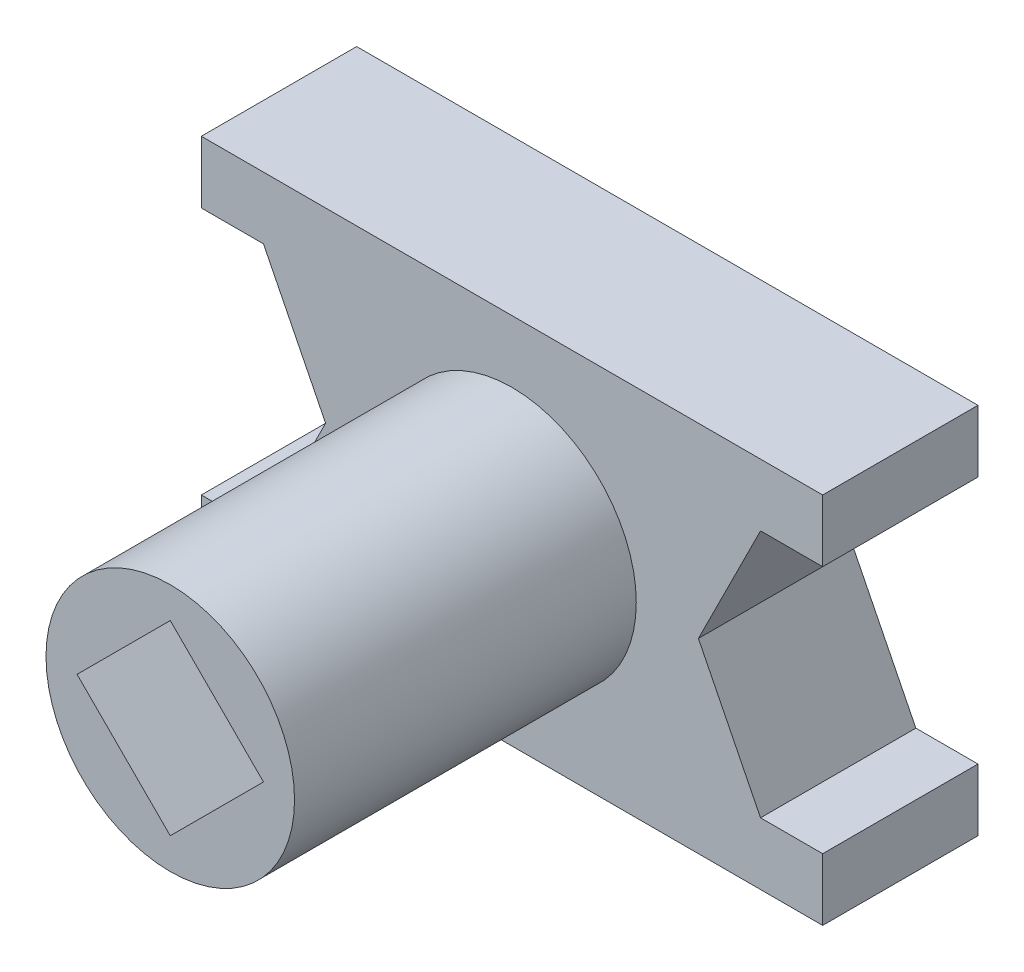
ISO-10303-21;
HEADER;
FILE_DESCRIPTION(('STEP AP214'),'2;1');
FILE_NAME('part.step','',(''),(''),'','','');
FILE_SCHEMA(('AUTOMOTIVE_DESIGN { 1 0 10303 214 1 1 1 1 }'));
ENDSEC;
DATA;
#1=APPLICATION_CONTEXT('core data for automotive mechanical design processes');
#2=APPLICATION_PROTOCOL_DEFINITION('international standard','automotive_design',2000,#1);
#3=PRODUCT_CONTEXT('',#1,'mechanical');
#4=PRODUCT('Part','Part','',(#3));
#5=PRODUCT_RELATED_PRODUCT_CATEGORY('part','',(#4));
#6=PRODUCT_DEFINITION_FORMATION('','',#4);
#7=PRODUCT_DEFINITION_CONTEXT('part definition',#1,'design');
#8=PRODUCT_DEFINITION('design','',#6,#7);
#9=PRODUCT_DEFINITION_SHAPE('','',#8);
#10=(LENGTH_UNIT() NAMED_UNIT(*) SI_UNIT(.MILLI.,.METRE.));
#11=(NAMED_UNIT(*) PLANE_ANGLE_UNIT() SI_UNIT($,.RADIAN.));
#12=(NAMED_UNIT(*) SI_UNIT($,.STERADIAN.) SOLID_ANGLE_UNIT());
#13=UNCERTAINTY_MEASURE_WITH_UNIT(LENGTH_MEASURE(1.E-05),#10,'distance_accuracy_value','');
#14=(GEOMETRIC_REPRESENTATION_CONTEXT(3) GLOBAL_UNCERTAINTY_ASSIGNED_CONTEXT((#13)) GLOBAL_UNIT_ASSIGNED_CONTEXT((#10,
#11,#12)) REPRESENTATION_CONTEXT('',''));
#15=CARTESIAN_POINT('',(0.,0.,0.));
#16=DIRECTION('',(0.,0.,1.));
#17=DIRECTION('',(1.,0.,0.));
#18=AXIS2_PLACEMENT_3D('',#15,#16,#17);
#19=CARTESIAN_POINT('',(-50.,20.,25.));
#20=DIRECTION('',(1.,0.,0.));
#21=DIRECTION('',(0.,0.,-1.));
#22=AXIS2_PLACEMENT_3D('',#19,#20,#21);
#23=PLANE('',#22);
#24=DIRECTION('',(0.,-1.,0.));
#25=VECTOR('',#24,1.);
#26=CARTESIAN_POINT('',(-50.,20.,0.));
#27=LINE('',#26,#25);
#28=CARTESIAN_POINT('',(-50.,30.,0.));
#29=VERTEX_POINT('',#28);
#30=CARTESIAN_POINT('',(-50.,20.,0.));
#31=VERTEX_POINT('',#30);
#32=EDGE_CURVE('E177',#29,#31,#27,.T.);
#33=ORIENTED_EDGE('',*,*,#32,.T.);
#34=DIRECTION('',(0.,0.,-1.));
#35=VECTOR('',#34,1.);
#36=CARTESIAN_POINT('',(-50.,20.,25.));
#37=LINE('',#36,#35);
#38=CARTESIAN_POINT('',(-50.,20.,25.));
#39=VERTEX_POINT('',#38);
#40=EDGE_CURVE('E11',#39,#31,#37,.T.);
#41=ORIENTED_EDGE('',*,*,#40,.F.);
#42=DIRECTION('',(0.,-1.,0.));
#43=VECTOR('',#42,1.);
#44=CARTESIAN_POINT('',(-50.,20.,25.));
#45=LINE('',#44,#43);
#46=CARTESIAN_POINT('',(-50.,30.,25.));
#47=VERTEX_POINT('',#46);
#48=EDGE_CURVE('E205',#47,#39,#45,.T.);
#49=ORIENTED_EDGE('',*,*,#48,.F.);
#50=DIRECTION('',(0.,0.,-1.));
#51=VECTOR('',#50,1.);
#52=CARTESIAN_POINT('',(-50.,30.,25.));
#53=LINE('',#52,#51);
#54=EDGE_CURVE('E173',#47,#29,#53,.T.);
#55=ORIENTED_EDGE('',*,*,#54,.T.);
#56=EDGE_LOOP('',(#33,#41,#49,#55));
#57=FACE_BOUND('',#56,.T.);
#58=ADVANCED_FACE('F33',(#57),#23,.F.);
#59=CARTESIAN_POINT('',(-50.,20.,25.));
#60=DIRECTION('',(0.,1.,0.));
#61=DIRECTION('',(0.,0.,1.));
#62=AXIS2_PLACEMENT_3D('',#59,#60,#61);
#63=PLANE('',#62);
#64=DIRECTION('',(1.,0.,0.));
#65=VECTOR('',#64,1.);
#66=CARTESIAN_POINT('',(-50.,20.,0.));
#67=LINE('',#66,#65);
#68=CARTESIAN_POINT('',(-40.,20.,0.));
#69=VERTEX_POINT('',#68);
#70=EDGE_CURVE('E180',#31,#69,#67,.T.);
#71=ORIENTED_EDGE('',*,*,#70,.T.);
#72=DIRECTION('',(0.,0.,-1.));
#73=VECTOR('',#72,1.);
#74=CARTESIAN_POINT('',(-40.,20.,25.));
#75=LINE('',#74,#73);
#76=CARTESIAN_POINT('',(-40.,20.,25.));
#77=VERTEX_POINT('',#76);
#78=EDGE_CURVE('E40',#77,#69,#75,.T.);
#79=ORIENTED_EDGE('',*,*,#78,.F.);
#80=DIRECTION('',(1.,0.,0.));
#81=VECTOR('',#80,1.);
#82=CARTESIAN_POINT('',(-50.,20.,25.));
#83=LINE('',#82,#81);
#84=EDGE_CURVE('E115',#39,#77,#83,.T.);
#85=ORIENTED_EDGE('',*,*,#84,.F.);
#86=ORIENTED_EDGE('',*,*,#40,.T.);
#87=EDGE_LOOP('',(#71,#79,#85,#86));
#88=FACE_BOUND('',#87,.T.);
#89=ADVANCED_FACE('F379',(#88),#63,.F.);
#90=CARTESIAN_POINT('',(-40.,20.,25.));
#91=DIRECTION('',(0.894427190999916,0.447213595499958,0.));
#92=DIRECTION('',(-0.447213595499958,0.894427190999916,0.));
#93=AXIS2_PLACEMENT_3D('',#90,#91,#92);
#94=PLANE('',#93);
#95=DIRECTION('',(0.447213595499958,-0.894427190999916,0.));
#96=VECTOR('',#95,1.);
#97=CARTESIAN_POINT('',(-40.,20.,0.));
#98=LINE('',#97,#96);
#99=CARTESIAN_POINT('',(-30.,0.,0.));
#100=VERTEX_POINT('',#99);
#101=EDGE_CURVE('E183',#69,#100,#98,.T.);
#102=ORIENTED_EDGE('',*,*,#101,.T.);
#103=DIRECTION('',(0.,0.,-1.));
#104=VECTOR('',#103,1.);
#105=CARTESIAN_POINT('',(-30.,0.,25.));
#106=LINE('',#105,#104);
#107=CARTESIAN_POINT('',(-30.,0.,25.));
#108=VERTEX_POINT('',#107);
#109=EDGE_CURVE('E230',#108,#100,#106,.T.);
#110=ORIENTED_EDGE('',*,*,#109,.F.);
#111=DIRECTION('',(0.447213595499958,-0.894427190999916,0.));
#112=VECTOR('',#111,1.);
#113=CARTESIAN_POINT('',(-40.,20.,25.));
#114=LINE('',#113,#112);
#115=EDGE_CURVE('E238',#77,#108,#114,.T.);
#116=ORIENTED_EDGE('',*,*,#115,.F.);
#117=ORIENTED_EDGE('',*,*,#78,.T.);
#118=EDGE_LOOP('',(#102,#110,#116,#117));
#119=FACE_BOUND('',#118,.T.);
#120=ADVANCED_FACE('F236',(#119),#94,.F.);
#121=CARTESIAN_POINT('',(-40.,-20.,25.));
#122=DIRECTION('',(0.894427190999916,-0.447213595499958,0.));
#123=DIRECTION('',(0.447213595499958,0.894427190999916,0.));
#124=AXIS2_PLACEMENT_3D('',#121,#122,#123);
#125=PLANE('',#124);
#126=DIRECTION('',(-0.447213595499958,-0.894427190999916,0.));
#127=VECTOR('',#126,1.);
#128=CARTESIAN_POINT('',(-40.,-20.,0.));
#129=LINE('',#128,#127);
#130=CARTESIAN_POINT('',(-40.,-20.,0.));
#131=VERTEX_POINT('',#130);
#132=EDGE_CURVE('E185',#100,#131,#129,.T.);
#133=ORIENTED_EDGE('',*,*,#132,.T.);
#134=DIRECTION('',(0.,0.,-1.));
#135=VECTOR('',#134,1.);
#136=CARTESIAN_POINT('',(-40.,-20.,25.));
#137=LINE('',#136,#135);
#138=CARTESIAN_POINT('',(-40.,-20.,25.));
#139=VERTEX_POINT('',#138);
#140=EDGE_CURVE('E227',#139,#131,#137,.T.);
#141=ORIENTED_EDGE('',*,*,#140,.F.);
#142=DIRECTION('',(-0.447213595499958,-0.894427190999916,0.));
#143=VECTOR('',#142,1.);
#144=CARTESIAN_POINT('',(-40.,-20.,25.));
#145=LINE('',#144,#143);
#146=EDGE_CURVE('E256',#108,#139,#145,.T.);
#147=ORIENTED_EDGE('',*,*,#146,.F.);
#148=ORIENTED_EDGE('',*,*,#109,.T.);
#149=EDGE_LOOP('',(#133,#141,#147,#148));
#150=FACE_BOUND('',#149,.T.);
#151=ADVANCED_FACE('F247',(#150),#125,.F.);
#152=CARTESIAN_POINT('',(-50.,-20.,25.));
#153=DIRECTION('',(0.,-1.,0.));
#154=DIRECTION('',(0.,0.,-1.));
#155=AXIS2_PLACEMENT_3D('',#152,#153,#154);
#156=PLANE('',#155);
#157=DIRECTION('',(-1.,0.,0.));
#158=VECTOR('',#157,1.);
#159=CARTESIAN_POINT('',(-50.,-20.,0.));
#160=LINE('',#159,#158);
#161=CARTESIAN_POINT('',(-50.,-20.,0.));
#162=VERTEX_POINT('',#161);
#163=EDGE_CURVE('E187',#131,#162,#160,.T.);
#164=ORIENTED_EDGE('',*,*,#163,.T.);
#165=DIRECTION('',(0.,0.,-1.));
#166=VECTOR('',#165,1.);
#167=CARTESIAN_POINT('',(-50.,-20.,25.));
#168=LINE('',#167,#166);
#169=CARTESIAN_POINT('',(-50.,-20.,25.));
#170=VERTEX_POINT('',#169);
#171=EDGE_CURVE('E224',#170,#162,#168,.T.);
#172=ORIENTED_EDGE('',*,*,#171,.F.);
#173=DIRECTION('',(-1.,0.,0.));
#174=VECTOR('',#173,1.);
#175=CARTESIAN_POINT('',(-50.,-20.,25.));
#176=LINE('',#175,#174);
#177=EDGE_CURVE('E253',#139,#170,#176,.T.);
#178=ORIENTED_EDGE('',*,*,#177,.F.);
#179=ORIENTED_EDGE('',*,*,#140,.T.);
#180=EDGE_LOOP('',(#164,#172,#178,#179));
#181=FACE_BOUND('',#180,.T.);
#182=ADVANCED_FACE('F251',(#181),#156,.F.);
#183=CARTESIAN_POINT('',(-50.,-30.,25.));
#184=DIRECTION('',(1.,0.,0.));
#185=DIRECTION('',(0.,0.,-1.));
#186=AXIS2_PLACEMENT_3D('',#183,#184,#185);
#187=PLANE('',#186);
#188=DIRECTION('',(0.,-1.,0.));
#189=VECTOR('',#188,1.);
#190=CARTESIAN_POINT('',(-50.,-30.,0.));
#191=LINE('',#190,#189);
#192=CARTESIAN_POINT('',(-50.,-30.,0.));
#193=VERTEX_POINT('',#192);
#194=EDGE_CURVE('E189',#162,#193,#191,.T.);
#195=ORIENTED_EDGE('',*,*,#194,.T.);
#196=DIRECTION('',(0.,0.,-1.));
#197=VECTOR('',#196,1.);
#198=CARTESIAN_POINT('',(-50.,-30.,25.));
#199=LINE('',#198,#197);
#200=CARTESIAN_POINT('',(-50.,-30.,25.));
#201=VERTEX_POINT('',#200);
#202=EDGE_CURVE('E221',#201,#193,#199,.T.);
#203=ORIENTED_EDGE('',*,*,#202,.F.);
#204=DIRECTION('',(0.,-1.,0.));
#205=VECTOR('',#204,1.);
#206=CARTESIAN_POINT('',(-50.,-30.,25.));
#207=LINE('',#206,#205);
#208=EDGE_CURVE('E255',#170,#201,#207,.T.);
#209=ORIENTED_EDGE('',*,*,#208,.F.);
#210=ORIENTED_EDGE('',*,*,#171,.T.);
#211=EDGE_LOOP('',(#195,#203,#209,#210));
#212=FACE_BOUND('',#211,.T.);
#213=ADVANCED_FACE('F392',(#212),#187,.F.);
#214=CARTESIAN_POINT('',(50.,-30.,25.));
#215=DIRECTION('',(0.,1.,0.));
#216=DIRECTION('',(-1.,0.,0.));
#217=AXIS2_PLACEMENT_3D('',#214,#215,#216);
#218=PLANE('',#217);
#219=DIRECTION('',(1.,0.,0.));
#220=VECTOR('',#219,1.);
#221=CARTESIAN_POINT('',(50.,-30.,0.));
#222=LINE('',#221,#220);
#223=CARTESIAN_POINT('',(50.,-30.,0.));
#224=VERTEX_POINT('',#223);
#225=EDGE_CURVE('E191',#193,#224,#222,.T.);
#226=ORIENTED_EDGE('',*,*,#225,.T.);
#227=DIRECTION('',(0.,0.,-1.));
#228=VECTOR('',#227,1.);
#229=CARTESIAN_POINT('',(50.,-30.,25.));
#230=LINE('',#229,#228);
#231=CARTESIAN_POINT('',(50.,-30.,25.));
#232=VERTEX_POINT('',#231);
#233=EDGE_CURVE('E218',#232,#224,#230,.T.);
#234=ORIENTED_EDGE('',*,*,#233,.F.);
#235=DIRECTION('',(1.,0.,0.));
#236=VECTOR('',#235,1.);
#237=CARTESIAN_POINT('',(50.,-30.,25.));
#238=LINE('',#237,#236);
#239=EDGE_CURVE('E258',#201,#232,#238,.T.);
#240=ORIENTED_EDGE('',*,*,#239,.F.);
#241=ORIENTED_EDGE('',*,*,#202,.T.);
#242=EDGE_LOOP('',(#226,#234,#240,#241));
#243=FACE_BOUND('',#242,.T.);
#244=ADVANCED_FACE('F395',(#243),#218,.F.);
#245=CARTESIAN_POINT('',(50.,-30.,25.));
#246=DIRECTION('',(-1.,0.,0.));
#247=DIRECTION('',(0.,-1.,0.));
#248=AXIS2_PLACEMENT_3D('',#245,#246,#247);
#249=PLANE('',#248);
#250=DIRECTION('',(0.,1.,0.));
#251=VECTOR('',#250,1.);
#252=CARTESIAN_POINT('',(50.,-30.,0.));
#253=LINE('',#252,#251);
#254=CARTESIAN_POINT('',(50.,-20.,0.));
#255=VERTEX_POINT('',#254);
#256=EDGE_CURVE('E193',#224,#255,#253,.T.);
#257=ORIENTED_EDGE('',*,*,#256,.T.);
#258=DIRECTION('',(0.,0.,-1.));
#259=VECTOR('',#258,1.);
#260=CARTESIAN_POINT('',(50.,-20.,25.));
#261=LINE('',#260,#259);
#262=CARTESIAN_POINT('',(50.,-20.,25.));
#263=VERTEX_POINT('',#262);
#264=EDGE_CURVE('E215',#263,#255,#261,.T.);
#265=ORIENTED_EDGE('',*,*,#264,.F.);
#266=DIRECTION('',(0.,1.,0.));
#267=VECTOR('',#266,1.);
#268=CARTESIAN_POINT('',(50.,-30.,25.));
#269=LINE('',#268,#267);
#270=EDGE_CURVE('E264',#232,#263,#269,.T.);
#271=ORIENTED_EDGE('',*,*,#270,.F.);
#272=ORIENTED_EDGE('',*,*,#233,.T.);
#273=EDGE_LOOP('',(#257,#265,#271,#272));
#274=FACE_BOUND('',#273,.T.);
#275=ADVANCED_FACE('F399',(#274),#249,.F.);
#276=CARTESIAN_POINT('',(50.,-20.,25.));
#277=DIRECTION('',(0.,-1.,0.));
#278=DIRECTION('',(0.,0.,-1.));
#279=AXIS2_PLACEMENT_3D('',#276,#277,#278);
#280=PLANE('',#279);
#281=DIRECTION('',(-1.,0.,0.));
#282=VECTOR('',#281,1.);
#283=CARTESIAN_POINT('',(50.,-20.,0.));
#284=LINE('',#283,#282);
#285=CARTESIAN_POINT('',(40.,-20.,0.));
#286=VERTEX_POINT('',#285);
#287=EDGE_CURVE('E195',#255,#286,#284,.T.);
#288=ORIENTED_EDGE('',*,*,#287,.T.);
#289=DIRECTION('',(0.,0.,-1.));
#290=VECTOR('',#289,1.);
#291=CARTESIAN_POINT('',(40.,-20.,25.));
#292=LINE('',#291,#290);
#293=CARTESIAN_POINT('',(40.,-20.,25.));
#294=VERTEX_POINT('',#293);
#295=EDGE_CURVE('E212',#294,#286,#292,.T.);
#296=ORIENTED_EDGE('',*,*,#295,.F.);
#297=DIRECTION('',(-1.,0.,0.));
#298=VECTOR('',#297,1.);
#299=CARTESIAN_POINT('',(50.,-20.,25.));
#300=LINE('',#299,#298);
#301=EDGE_CURVE('E266',#263,#294,#300,.T.);
#302=ORIENTED_EDGE('',*,*,#301,.F.);
#303=ORIENTED_EDGE('',*,*,#264,.T.);
#304=EDGE_LOOP('',(#288,#296,#302,#303));
#305=FACE_BOUND('',#304,.T.);
#306=ADVANCED_FACE('F403',(#305),#280,.F.);
#307=CARTESIAN_POINT('',(40.,-20.,25.));
#308=DIRECTION('',(-0.894427190999915,-0.447213595499959,0.));
#309=DIRECTION('',(0.447213595499959,-0.894427190999916,0.));
#310=AXIS2_PLACEMENT_3D('',#307,#308,#309);
#311=PLANE('',#310);
#312=DIRECTION('',(-0.447213595499959,0.894427190999916,0.));
#313=VECTOR('',#312,1.);
#314=CARTESIAN_POINT('',(40.,-20.,0.));
#315=LINE('',#314,#313);
#316=CARTESIAN_POINT('',(30.,0.,0.));
#317=VERTEX_POINT('',#316);
#318=EDGE_CURVE('E197',#286,#317,#315,.T.);
#319=ORIENTED_EDGE('',*,*,#318,.T.);
#320=DIRECTION('',(0.,0.,-1.));
#321=VECTOR('',#320,1.);
#322=CARTESIAN_POINT('',(30.,0.,25.));
#323=LINE('',#322,#321);
#324=CARTESIAN_POINT('',(30.,0.,25.));
#325=VERTEX_POINT('',#324);
#326=EDGE_CURVE('E209',#325,#317,#323,.T.);
#327=ORIENTED_EDGE('',*,*,#326,.F.);
#328=DIRECTION('',(-0.447213595499959,0.894427190999916,0.));
#329=VECTOR('',#328,1.);
#330=CARTESIAN_POINT('',(40.,-20.,25.));
#331=LINE('',#330,#329);
#332=EDGE_CURVE('E268',#294,#325,#331,.T.);
#333=ORIENTED_EDGE('',*,*,#332,.F.);
#334=ORIENTED_EDGE('',*,*,#295,.T.);
#335=EDGE_LOOP('',(#319,#327,#333,#334));
#336=FACE_BOUND('',#335,.T.);
#337=ADVANCED_FACE('F274',(#336),#311,.F.);
#338=CARTESIAN_POINT('',(40.,20.,25.));
#339=DIRECTION('',(-0.894427190999916,0.447213595499958,0.));
#340=DIRECTION('',(-0.447213595499958,-0.894427190999916,0.));
#341=AXIS2_PLACEMENT_3D('',#338,#339,#340);
#342=PLANE('',#341);
#343=DIRECTION('',(0.447213595499958,0.894427190999916,0.));
#344=VECTOR('',#343,1.);
#345=CARTESIAN_POINT('',(40.,20.,0.));
#346=LINE('',#345,#344);
#347=CARTESIAN_POINT('',(40.,20.,0.));
#348=VERTEX_POINT('',#347);
#349=EDGE_CURVE('E199',#317,#348,#346,.T.);
#350=ORIENTED_EDGE('',*,*,#349,.T.);
#351=DIRECTION('',(0.,0.,-1.));
#352=VECTOR('',#351,1.);
#353=CARTESIAN_POINT('',(40.,20.,25.));
#354=LINE('',#353,#352);
#355=CARTESIAN_POINT('',(40.,20.,25.));
#356=VERTEX_POINT('',#355);
#357=EDGE_CURVE('E168',#356,#348,#354,.T.);
#358=ORIENTED_EDGE('',*,*,#357,.F.);
#359=DIRECTION('',(0.447213595499958,0.894427190999916,0.));
#360=VECTOR('',#359,1.);
#361=CARTESIAN_POINT('',(40.,20.,25.));
#362=LINE('',#361,#360);
#363=EDGE_CURVE('E156',#325,#356,#362,.T.);
#364=ORIENTED_EDGE('',*,*,#363,.F.);
#365=ORIENTED_EDGE('',*,*,#326,.T.);
#366=EDGE_LOOP('',(#350,#358,#364,#365));
#367=FACE_BOUND('',#366,.T.);
#368=ADVANCED_FACE('F278',(#367),#342,.F.);
#369=CARTESIAN_POINT('',(50.,20.,25.));
#370=DIRECTION('',(0.,1.,0.));
#371=DIRECTION('',(0.,0.,1.));
#372=AXIS2_PLACEMENT_3D('',#369,#370,#371);
#373=PLANE('',#372);
#374=DIRECTION('',(1.,0.,0.));
#375=VECTOR('',#374,1.);
#376=CARTESIAN_POINT('',(50.,20.,0.));
#377=LINE('',#376,#375);
#378=CARTESIAN_POINT('',(50.,20.,0.));
#379=VERTEX_POINT('',#378);
#380=EDGE_CURVE('E165',#348,#379,#377,.T.);
#381=ORIENTED_EDGE('',*,*,#380,.T.);
#382=DIRECTION('',(0.,0.,-1.));
#383=VECTOR('',#382,1.);
#384=CARTESIAN_POINT('',(50.,20.,25.));
#385=LINE('',#384,#383);
#386=CARTESIAN_POINT('',(50.,20.,25.));
#387=VERTEX_POINT('',#386);
#388=EDGE_CURVE('E162',#387,#379,#385,.T.);
#389=ORIENTED_EDGE('',*,*,#388,.F.);
#390=DIRECTION('',(1.,0.,0.));
#391=VECTOR('',#390,1.);
#392=CARTESIAN_POINT('',(50.,20.,25.));
#393=LINE('',#392,#391);
#394=EDGE_CURVE('E149',#356,#387,#393,.T.);
#395=ORIENTED_EDGE('',*,*,#394,.F.);
#396=ORIENTED_EDGE('',*,*,#357,.T.);
#397=EDGE_LOOP('',(#381,#389,#395,#396));
#398=FACE_BOUND('',#397,.T.);
#399=ADVANCED_FACE('F163',(#398),#373,.F.);
#400=CARTESIAN_POINT('',(50.,20.,25.));
#401=DIRECTION('',(-1.,0.,0.));
#402=DIRECTION('',(0.,0.,1.));
#403=AXIS2_PLACEMENT_3D('',#400,#401,#402);
#404=PLANE('',#403);
#405=DIRECTION('',(0.,1.,0.));
#406=VECTOR('',#405,1.);
#407=CARTESIAN_POINT('',(50.,20.,0.));
#408=LINE('',#407,#406);
#409=CARTESIAN_POINT('',(50.,30.,0.));
#410=VERTEX_POINT('',#409);
#411=EDGE_CURVE('E202',#379,#410,#408,.T.);
#412=ORIENTED_EDGE('',*,*,#411,.T.);
#413=DIRECTION('',(0.,0.,-1.));
#414=VECTOR('',#413,1.);
#415=CARTESIAN_POINT('',(50.,30.,25.));
#416=LINE('',#415,#414);
#417=CARTESIAN_POINT('',(50.,30.,25.));
#418=VERTEX_POINT('',#417);
#419=EDGE_CURVE('E169',#418,#410,#416,.T.);
#420=ORIENTED_EDGE('',*,*,#419,.F.);
#421=DIRECTION('',(0.,1.,0.));
#422=VECTOR('',#421,1.);
#423=CARTESIAN_POINT('',(50.,20.,25.));
#424=LINE('',#423,#422);
#425=EDGE_CURVE('E153',#387,#418,#424,.T.);
#426=ORIENTED_EDGE('',*,*,#425,.F.);
#427=ORIENTED_EDGE('',*,*,#388,.T.);
#428=EDGE_LOOP('',(#412,#420,#426,#427));
#429=FACE_BOUND('',#428,.T.);
#430=ADVANCED_FACE('F171',(#429),#404,.F.);
#431=CARTESIAN_POINT('',(50.,30.,25.));
#432=DIRECTION('',(0.,-1.,0.));
#433=DIRECTION('',(1.,0.,0.));
#434=AXIS2_PLACEMENT_3D('',#431,#432,#433);
#435=PLANE('',#434);
#436=DIRECTION('',(-1.,0.,0.));
#437=VECTOR('',#436,1.);
#438=CARTESIAN_POINT('',(50.,30.,0.));
#439=LINE('',#438,#437);
#440=EDGE_CURVE('E107',#410,#29,#439,.T.);
#441=ORIENTED_EDGE('',*,*,#440,.T.);
#442=ORIENTED_EDGE('',*,*,#54,.F.);
#443=DIRECTION('',(-1.,0.,0.));
#444=VECTOR('',#443,1.);
#445=CARTESIAN_POINT('',(50.,30.,25.));
#446=LINE('',#445,#444);
#447=EDGE_CURVE('E56',#418,#47,#446,.T.);
#448=ORIENTED_EDGE('',*,*,#447,.F.);
#449=ORIENTED_EDGE('',*,*,#419,.T.);
#450=EDGE_LOOP('',(#441,#442,#448,#449));
#451=FACE_BOUND('',#450,.T.);
#452=ADVANCED_FACE('F279',(#451),#435,.F.);
#453=CARTESIAN_POINT('',(0.,0.,25.));
#454=DIRECTION('',(0.,0.,1.));
#455=DIRECTION('',(1.,0.,0.));
#456=AXIS2_PLACEMENT_3D('',#453,#454,#455);
#457=PLANE('',#456);
#458=CARTESIAN_POINT('',(0.,0.,25.));
#459=DIRECTION('',(0.,0.,1.));
#460=DIRECTION('',(1.,0.,0.));
#461=AXIS2_PLACEMENT_3D('',#458,#459,#460);
#462=CIRCLE('',#461,20.);
#463=CARTESIAN_POINT('',(20.,0.,25.));
#464=VERTEX_POINT('',#463);
#465=EDGE_CURVE('E286',#464,#464,#462,.T.);
#466=ORIENTED_EDGE('',*,*,#465,.F.);
#467=EDGE_LOOP('',(#466));
#468=FACE_BOUND('',#467,.T.);
#469=ORIENTED_EDGE('',*,*,#48,.T.);
#470=ORIENTED_EDGE('',*,*,#84,.T.);
#471=ORIENTED_EDGE('',*,*,#115,.T.);
#472=ORIENTED_EDGE('',*,*,#146,.T.);
#473=ORIENTED_EDGE('',*,*,#177,.T.);
#474=ORIENTED_EDGE('',*,*,#208,.T.);
#475=ORIENTED_EDGE('',*,*,#239,.T.);
#476=ORIENTED_EDGE('',*,*,#270,.T.);
#477=ORIENTED_EDGE('',*,*,#301,.T.);
#478=ORIENTED_EDGE('',*,*,#332,.T.);
#479=ORIENTED_EDGE('',*,*,#363,.T.);
#480=ORIENTED_EDGE('',*,*,#394,.T.);
#481=ORIENTED_EDGE('',*,*,#425,.T.);
#482=ORIENTED_EDGE('',*,*,#447,.T.);
#483=EDGE_LOOP('',(#469,#470,#471,#472,#473,#474,#475,#476,#477,#478,#479,#480,#481,#482));
#484=FACE_BOUND('',#483,.T.);
#485=ADVANCED_FACE('F151',(#468,#484),#457,.T.);
#486=CARTESIAN_POINT('',(0.,0.,0.));
#487=DIRECTION('',(0.,0.,1.));
#488=DIRECTION('',(1.,0.,0.));
#489=AXIS2_PLACEMENT_3D('',#486,#487,#488);
#490=PLANE('',#489);
#491=CARTESIAN_POINT('',(0.,0.,0.));
#492=DIRECTION('',(0.,0.,1.));
#493=DIRECTION('',(1.,0.,0.));
#494=AXIS2_PLACEMENT_3D('',#491,#492,#493);
#495=CIRCLE('',#494,8.);
#496=CARTESIAN_POINT('',(8.,0.,0.));
#497=VERTEX_POINT('',#496);
#498=EDGE_CURVE('E313',#497,#497,#495,.T.);
#499=ORIENTED_EDGE('',*,*,#498,.T.);
#500=EDGE_LOOP('',(#499));
#501=FACE_BOUND('',#500,.T.);
#502=ORIENTED_EDGE('',*,*,#32,.F.);
#503=ORIENTED_EDGE('',*,*,#440,.F.);
#504=ORIENTED_EDGE('',*,*,#411,.F.);
#505=ORIENTED_EDGE('',*,*,#380,.F.);
#506=ORIENTED_EDGE('',*,*,#349,.F.);
#507=ORIENTED_EDGE('',*,*,#318,.F.);
#508=ORIENTED_EDGE('',*,*,#287,.F.);
#509=ORIENTED_EDGE('',*,*,#256,.F.);
#510=ORIENTED_EDGE('',*,*,#225,.F.);
#511=ORIENTED_EDGE('',*,*,#194,.F.);
#512=ORIENTED_EDGE('',*,*,#163,.F.);
#513=ORIENTED_EDGE('',*,*,#132,.F.);
#514=ORIENTED_EDGE('',*,*,#101,.F.);
#515=ORIENTED_EDGE('',*,*,#70,.F.);
#516=EDGE_LOOP('',(#502,#503,#504,#505,#506,#507,#508,#509,#510,#511,#512,#513,#514,#515));
#517=FACE_BOUND('',#516,.T.);
#518=ADVANCED_FACE('F242',(#501,#517),#490,.F.);
#519=CARTESIAN_POINT('',(0.,0.,80.));
#520=DIRECTION('',(0.,0.,-1.));
#521=DIRECTION('',(-1.,0.,0.));
#522=AXIS2_PLACEMENT_3D('',#519,#520,#521);
#523=CYLINDRICAL_SURFACE('',#522,20.);
#524=CARTESIAN_POINT('',(0.,0.,80.));
#525=DIRECTION('',(0.,0.,1.));
#526=DIRECTION('',(1.,0.,0.));
#527=AXIS2_PLACEMENT_3D('',#524,#525,#526);
#528=CIRCLE('',#527,20.);
#529=CARTESIAN_POINT('',(20.,0.,80.));
#530=VERTEX_POINT('',#529);
#531=EDGE_CURVE('E181',#530,#530,#528,.T.);
#532=ORIENTED_EDGE('',*,*,#531,.F.);
#533=EDGE_LOOP('',(#532));
#534=FACE_BOUND('',#533,.T.);
#535=ORIENTED_EDGE('',*,*,#465,.T.);
#536=EDGE_LOOP('',(#535));
#537=FACE_BOUND('',#536,.T.);
#538=ADVANCED_FACE('F420',(#534,#537),#523,.T.);
#539=CARTESIAN_POINT('',(0.,0.,80.));
#540=DIRECTION('',(0.,0.,1.));
#541=DIRECTION('',(1.,0.,0.));
#542=AXIS2_PLACEMENT_3D('',#539,#540,#541);
#543=PLANE('',#542);
#544=DIRECTION('',(0.707106781186549,-0.707106781186546,0.));
#545=VECTOR('',#544,1.);
#546=CARTESIAN_POINT('',(0.,-15.,80.));
#547=LINE('',#546,#545);
#548=CARTESIAN_POINT('',(-15.0000000000002,0.,80.));
#549=VERTEX_POINT('',#548);
#550=CARTESIAN_POINT('',(0.,-15.,80.));
#551=VERTEX_POINT('',#550);
#552=EDGE_CURVE('E47',#549,#551,#547,.T.);
#553=ORIENTED_EDGE('',*,*,#552,.F.);
#554=DIRECTION('',(-0.707106781186546,-0.707106781186549,0.));
#555=VECTOR('',#554,1.);
#556=CARTESIAN_POINT('',(-1.11022302462516E-13,15.0000000000002,80.));
#557=LINE('',#556,#555);
#558=CARTESIAN_POINT('',(-1.11022302462516E-13,15.0000000000002,80.));
#559=VERTEX_POINT('',#558);
#560=EDGE_CURVE('E302',#559,#549,#557,.T.);
#561=ORIENTED_EDGE('',*,*,#560,.F.);
#562=DIRECTION('',(-0.707106781186549,0.707106781186546,0.));
#563=VECTOR('',#562,1.);
#564=CARTESIAN_POINT('',(15.,1.10154940724527E-13,80.));
#565=LINE('',#564,#563);
#566=CARTESIAN_POINT('',(15.,1.10154940724527E-13,80.));
#567=VERTEX_POINT('',#566);
#568=EDGE_CURVE('E306',#567,#559,#565,.T.);
#569=ORIENTED_EDGE('',*,*,#568,.F.);
#570=DIRECTION('',(0.707106781186546,0.707106781186549,0.));
#571=VECTOR('',#570,1.);
#572=CARTESIAN_POINT('',(15.,1.10154940724527E-13,80.));
#573=LINE('',#572,#571);
#574=EDGE_CURVE('E309',#551,#567,#573,.T.);
#575=ORIENTED_EDGE('',*,*,#574,.F.);
#576=EDGE_LOOP('',(#553,#561,#569,#575));
#577=FACE_BOUND('',#576,.T.);
#578=ORIENTED_EDGE('',*,*,#531,.T.);
#579=EDGE_LOOP('',(#578));
#580=FACE_BOUND('',#579,.T.);
#581=ADVANCED_FACE('F368',(#577,#580),#543,.T.);
#582=CARTESIAN_POINT('',(0.,-15.,40.));
#583=DIRECTION('',(-0.707106781186546,-0.707106781186549,0.));
#584=DIRECTION('',(0.707106781186549,-0.707106781186546,0.));
#585=AXIS2_PLACEMENT_3D('',#582,#583,#584);
#586=PLANE('',#585);
#587=ORIENTED_EDGE('',*,*,#552,.T.);
#588=DIRECTION('',(0.,0.,1.));
#589=VECTOR('',#588,1.);
#590=CARTESIAN_POINT('',(0.,-15.,40.));
#591=LINE('',#590,#589);
#592=CARTESIAN_POINT('',(0.,-15.,40.));
#593=VERTEX_POINT('',#592);
#594=EDGE_CURVE('E292',#593,#551,#591,.T.);
#595=ORIENTED_EDGE('',*,*,#594,.F.);
#596=DIRECTION('',(0.707106781186549,-0.707106781186546,0.));
#597=VECTOR('',#596,1.);
#598=CARTESIAN_POINT('',(0.,-15.,40.));
#599=LINE('',#598,#597);
#600=CARTESIAN_POINT('',(-15.0000000000002,0.,40.));
#601=VERTEX_POINT('',#600);
#602=EDGE_CURVE('E305',#601,#593,#599,.T.);
#603=ORIENTED_EDGE('',*,*,#602,.F.);
#604=DIRECTION('',(0.,0.,1.));
#605=VECTOR('',#604,1.);
#606=CARTESIAN_POINT('',(-15.0000000000002,0.,40.));
#607=LINE('',#606,#605);
#608=EDGE_CURVE('E289',#601,#549,#607,.T.);
#609=ORIENTED_EDGE('',*,*,#608,.T.);
#610=EDGE_LOOP('',(#587,#595,#603,#609));
#611=FACE_BOUND('',#610,.T.);
#612=ADVANCED_FACE('F348',(#611),#586,.F.);
#613=CARTESIAN_POINT('',(-1.11022302462516E-13,15.0000000000002,40.));
#614=DIRECTION('',(-0.707106781186549,0.707106781186546,0.));
#615=DIRECTION('',(-0.707106781186546,-0.707106781186549,0.));
#616=AXIS2_PLACEMENT_3D('',#613,#614,#615);
#617=PLANE('',#616);
#618=ORIENTED_EDGE('',*,*,#560,.T.);
#619=ORIENTED_EDGE('',*,*,#608,.F.);
#620=DIRECTION('',(-0.707106781186546,-0.707106781186549,0.));
#621=VECTOR('',#620,1.);
#622=CARTESIAN_POINT('',(-1.11022302462516E-13,15.0000000000002,40.));
#623=LINE('',#622,#621);
#624=CARTESIAN_POINT('',(-1.11022302462516E-13,15.0000000000002,40.));
#625=VERTEX_POINT('',#624);
#626=EDGE_CURVE('E295',#625,#601,#623,.T.);
#627=ORIENTED_EDGE('',*,*,#626,.F.);
#628=DIRECTION('',(0.,0.,1.));
#629=VECTOR('',#628,1.);
#630=CARTESIAN_POINT('',(-1.11022302462516E-13,15.0000000000002,40.));
#631=LINE('',#630,#629);
#632=EDGE_CURVE('E298',#625,#559,#631,.T.);
#633=ORIENTED_EDGE('',*,*,#632,.T.);
#634=EDGE_LOOP('',(#618,#619,#627,#633));
#635=FACE_BOUND('',#634,.T.);
#636=ADVANCED_FACE('F359',(#635),#617,.F.);
#637=CARTESIAN_POINT('',(15.,1.10154940724527E-13,40.));
#638=DIRECTION('',(0.707106781186546,0.707106781186549,0.));
#639=DIRECTION('',(-0.707106781186549,0.707106781186546,0.));
#640=AXIS2_PLACEMENT_3D('',#637,#638,#639);
#641=PLANE('',#640);
#642=ORIENTED_EDGE('',*,*,#568,.T.);
#643=ORIENTED_EDGE('',*,*,#632,.F.);
#644=DIRECTION('',(-0.707106781186549,0.707106781186546,0.));
#645=VECTOR('',#644,1.);
#646=CARTESIAN_POINT('',(15.,1.10154940724527E-13,40.));
#647=LINE('',#646,#645);
#648=CARTESIAN_POINT('',(15.,1.10154940724527E-13,40.));
#649=VERTEX_POINT('',#648);
#650=EDGE_CURVE('E316',#649,#625,#647,.T.);
#651=ORIENTED_EDGE('',*,*,#650,.F.);
#652=DIRECTION('',(0.,0.,1.));
#653=VECTOR('',#652,1.);
#654=CARTESIAN_POINT('',(15.,1.10154940724527E-13,40.));
#655=LINE('',#654,#653);
#656=EDGE_CURVE('E294',#649,#567,#655,.T.);
#657=ORIENTED_EDGE('',*,*,#656,.T.);
#658=EDGE_LOOP('',(#642,#643,#651,#657));
#659=FACE_BOUND('',#658,.T.);
#660=ADVANCED_FACE('F364',(#659),#641,.F.);
#661=CARTESIAN_POINT('',(15.,1.10154940724527E-13,40.));
#662=DIRECTION('',(0.707106781186549,-0.707106781186546,0.));
#663=DIRECTION('',(0.707106781186546,0.707106781186549,0.));
#664=AXIS2_PLACEMENT_3D('',#661,#662,#663);
#665=PLANE('',#664);
#666=ORIENTED_EDGE('',*,*,#574,.T.);
#667=ORIENTED_EDGE('',*,*,#656,.F.);
#668=DIRECTION('',(0.707106781186546,0.707106781186549,0.));
#669=VECTOR('',#668,1.);
#670=CARTESIAN_POINT('',(15.,1.10154940724527E-13,40.));
#671=LINE('',#670,#669);
#672=EDGE_CURVE('E319',#593,#649,#671,.T.);
#673=ORIENTED_EDGE('',*,*,#672,.F.);
#674=ORIENTED_EDGE('',*,*,#594,.T.);
#675=EDGE_LOOP('',(#666,#667,#673,#674));
#676=FACE_BOUND('',#675,.T.);
#677=ADVANCED_FACE('F340',(#676),#665,.F.);
#678=CARTESIAN_POINT('',(0.,0.,40.));
#679=DIRECTION('',(0.,0.,1.));
#680=DIRECTION('',(1.,0.,0.));
#681=AXIS2_PLACEMENT_3D('',#678,#679,#680);
#682=PLANE('',#681);
#683=CARTESIAN_POINT('',(0.,0.,40.));
#684=DIRECTION('',(0.,0.,1.));
#685=DIRECTION('',(1.,0.,0.));
#686=AXIS2_PLACEMENT_3D('',#683,#684,#685);
#687=CIRCLE('',#686,8.);
#688=CARTESIAN_POINT('',(8.,0.,40.));
#689=VERTEX_POINT('',#688);
#690=EDGE_CURVE('E324',#689,#689,#687,.T.);
#691=ORIENTED_EDGE('',*,*,#690,.F.);
#692=EDGE_LOOP('',(#691));
#693=FACE_BOUND('',#692,.T.);
#694=ORIENTED_EDGE('',*,*,#602,.T.);
#695=ORIENTED_EDGE('',*,*,#672,.T.);
#696=ORIENTED_EDGE('',*,*,#650,.T.);
#697=ORIENTED_EDGE('',*,*,#626,.T.);
#698=EDGE_LOOP('',(#694,#695,#696,#697));
#699=FACE_BOUND('',#698,.T.);
#700=ADVANCED_FACE('F334',(#693,#699),#682,.T.);
#701=CARTESIAN_POINT('',(0.,0.,0.));
#702=DIRECTION('',(0.,0.,1.));
#703=DIRECTION('',(1.,0.,0.));
#704=AXIS2_PLACEMENT_3D('',#701,#702,#703);
#705=CYLINDRICAL_SURFACE('',#704,8.);
#706=ORIENTED_EDGE('',*,*,#498,.F.);
#707=EDGE_LOOP('',(#706));
#708=FACE_BOUND('',#707,.T.);
#709=ORIENTED_EDGE('',*,*,#690,.T.);
#710=EDGE_LOOP('',(#709));
#711=FACE_BOUND('',#710,.T.);
#712=ADVANCED_FACE('F331',(#708,#711),#705,.F.);
#713=CLOSED_SHELL('',(#58,#89,#120,#151,#182,#213,#244,#275,#306,#337,#368,#399,#430,#452,#485,
#518,#538,#581,#612,#636,#660,#677,#700,#712));
#714=MANIFOLD_SOLID_BREP('B2',#713);
#715=ADVANCED_BREP_SHAPE_REPRESENTATION('',(#18,#714),#14);
#716=SHAPE_DEFINITION_REPRESENTATION(#9,#715);
ENDSEC;
END-ISO-10303-21;
